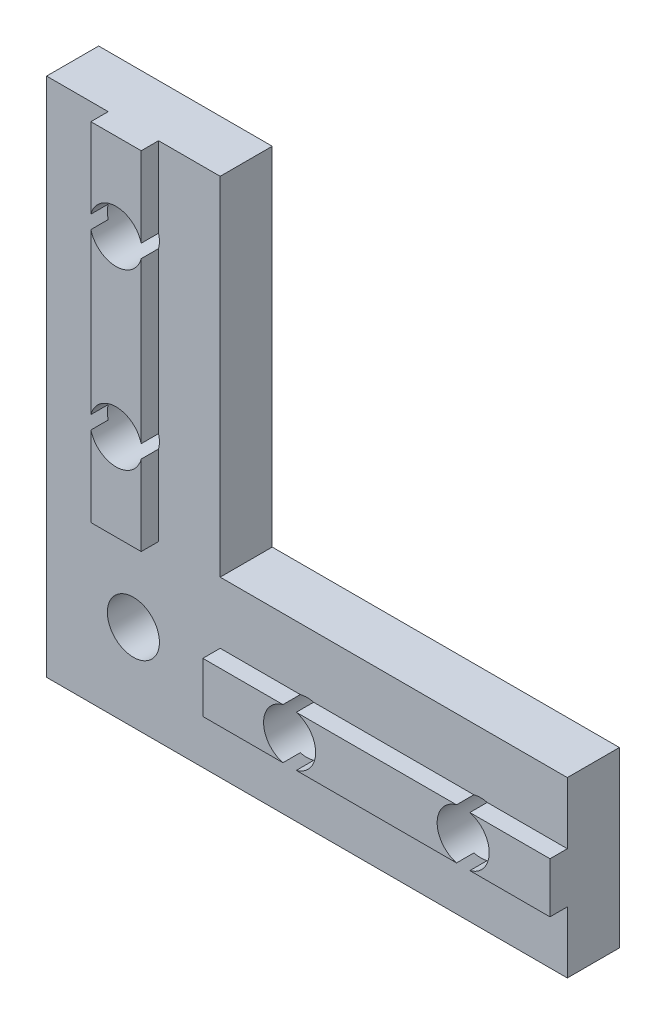
ISO-10303-21;
HEADER;
FILE_DESCRIPTION(('STEP AP214'),'2;1');
FILE_NAME('part.step','',(''),(''),'','','');
FILE_SCHEMA(('AUTOMOTIVE_DESIGN { 1 0 10303 214 1 1 1 1 }'));
ENDSEC;
DATA;
#1=APPLICATION_CONTEXT('core data for automotive mechanical design processes');
#2=APPLICATION_PROTOCOL_DEFINITION('international standard','automotive_design',2000,#1);
#3=PRODUCT_CONTEXT('',#1,'mechanical');
#4=PRODUCT('Part','Part','',(#3));
#5=PRODUCT_RELATED_PRODUCT_CATEGORY('part','',(#4));
#6=PRODUCT_DEFINITION_FORMATION('','',#4);
#7=PRODUCT_DEFINITION_CONTEXT('part definition',#1,'design');
#8=PRODUCT_DEFINITION('design','',#6,#7);
#9=PRODUCT_DEFINITION_SHAPE('','',#8);
#10=(LENGTH_UNIT() NAMED_UNIT(*) SI_UNIT(.MILLI.,.METRE.));
#11=(NAMED_UNIT(*) PLANE_ANGLE_UNIT() SI_UNIT($,.RADIAN.));
#12=(NAMED_UNIT(*) SI_UNIT($,.STERADIAN.) SOLID_ANGLE_UNIT());
#13=UNCERTAINTY_MEASURE_WITH_UNIT(LENGTH_MEASURE(1.E-05),#10,'distance_accuracy_value','');
#14=(GEOMETRIC_REPRESENTATION_CONTEXT(3) GLOBAL_UNCERTAINTY_ASSIGNED_CONTEXT((#13)) GLOBAL_UNIT_ASSIGNED_CONTEXT((#10,
#11,#12)) REPRESENTATION_CONTEXT('',''));
#15=CARTESIAN_POINT('',(0.,0.,0.));
#16=DIRECTION('',(0.,0.,1.));
#17=DIRECTION('',(1.,0.,0.));
#18=AXIS2_PLACEMENT_3D('',#15,#16,#17);
#19=CARTESIAN_POINT('',(6.45,30.,4.));
#20=DIRECTION('',(-1.,0.,0.));
#21=DIRECTION('',(0.,-1.,0.));
#22=AXIS2_PLACEMENT_3D('',#19,#20,#21);
#23=PLANE('',#22);
#24=DIRECTION('',(0.,1.,0.));
#25=VECTOR('',#24,1.);
#26=CARTESIAN_POINT('',(6.45,30.,3.));
#27=LINE('',#26,#25);
#28=CARTESIAN_POINT('',(6.45,10.,3.));
#29=VERTEX_POINT('',#28);
#30=CARTESIAN_POINT('',(6.45,14.6159427126066,3.));
#31=VERTEX_POINT('',#30);
#32=EDGE_CURVE('E332',#29,#31,#27,.T.);
#33=ORIENTED_EDGE('',*,*,#32,.T.);
#34=DIRECTION('',(0.,0.,1.));
#35=VECTOR('',#34,1.);
#36=CARTESIAN_POINT('',(6.45,14.6159427126066,0.));
#37=LINE('',#36,#35);
#38=CARTESIAN_POINT('',(6.45,14.6159427126066,4.));
#39=VERTEX_POINT('',#38);
#40=EDGE_CURVE('E288',#31,#39,#37,.T.);
#41=ORIENTED_EDGE('',*,*,#40,.T.);
#42=DIRECTION('',(0.,1.,0.));
#43=VECTOR('',#42,1.);
#44=CARTESIAN_POINT('',(6.45,30.,4.));
#45=LINE('',#44,#43);
#46=CARTESIAN_POINT('',(6.45,10.,4.));
#47=VERTEX_POINT('',#46);
#48=EDGE_CURVE('E339',#47,#39,#45,.T.);
#49=ORIENTED_EDGE('',*,*,#48,.F.);
#50=DIRECTION('',(0.,0.,-1.));
#51=VECTOR('',#50,1.);
#52=CARTESIAN_POINT('',(6.45,10.,4.));
#53=LINE('',#52,#51);
#54=EDGE_CURVE('E362',#47,#29,#53,.T.);
#55=ORIENTED_EDGE('',*,*,#54,.T.);
#56=EDGE_LOOP('',(#33,#41,#49,#55));
#57=FACE_BOUND('',#56,.T.);
#58=ADVANCED_FACE('F33',(#57),#23,.F.);
#59=CARTESIAN_POINT('',(3.55,30.,4.));
#60=DIRECTION('',(1.,0.,0.));
#61=DIRECTION('',(0.,1.,0.));
#62=AXIS2_PLACEMENT_3D('',#59,#60,#61);
#63=PLANE('',#62);
#64=DIRECTION('',(0.,-1.,0.));
#65=VECTOR('',#64,1.);
#66=CARTESIAN_POINT('',(3.55,30.,3.));
#67=LINE('',#66,#65);
#68=CARTESIAN_POINT('',(3.55,24.6159427126066,3.));
#69=VERTEX_POINT('',#68);
#70=CARTESIAN_POINT('',(3.55,15.3840572873934,3.));
#71=VERTEX_POINT('',#70);
#72=EDGE_CURVE('E323',#69,#71,#67,.T.);
#73=ORIENTED_EDGE('',*,*,#72,.T.);
#74=DIRECTION('',(0.,0.,1.));
#75=VECTOR('',#74,1.);
#76=CARTESIAN_POINT('',(3.55,15.3840572873934,0.));
#77=LINE('',#76,#75);
#78=CARTESIAN_POINT('',(3.55,15.3840572873934,4.));
#79=VERTEX_POINT('',#78);
#80=EDGE_CURVE('E291',#71,#79,#77,.T.);
#81=ORIENTED_EDGE('',*,*,#80,.T.);
#82=DIRECTION('',(0.,-1.,0.));
#83=VECTOR('',#82,1.);
#84=CARTESIAN_POINT('',(3.55,30.,4.));
#85=LINE('',#84,#83);
#86=CARTESIAN_POINT('',(3.55,24.6159427126066,4.));
#87=VERTEX_POINT('',#86);
#88=EDGE_CURVE('E321',#87,#79,#85,.T.);
#89=ORIENTED_EDGE('',*,*,#88,.F.);
#90=DIRECTION('',(0.,0.,1.));
#91=VECTOR('',#90,1.);
#92=CARTESIAN_POINT('',(3.55,24.6159427126066,0.));
#93=LINE('',#92,#91);
#94=EDGE_CURVE('E280',#87,#69,#93,.F.);
#95=ORIENTED_EDGE('',*,*,#94,.T.);
#96=EDGE_LOOP('',(#73,#81,#89,#95));
#97=FACE_BOUND('',#96,.T.);
#98=ADVANCED_FACE('F320',(#97),#63,.F.);
#99=CARTESIAN_POINT('',(0.,0.,4.));
#100=DIRECTION('',(0.,0.,1.));
#101=DIRECTION('',(1.,0.,0.));
#102=AXIS2_PLACEMENT_3D('',#99,#100,#101);
#103=PLANE('',#102);
#104=CARTESIAN_POINT('',(5.,15.,4.));
#105=DIRECTION('',(0.,0.,1.));
#106=DIRECTION('',(1.,0.,0.));
#107=AXIS2_PLACEMENT_3D('',#104,#105,#106);
#108=CIRCLE('',#107,1.5);
#109=CARTESIAN_POINT('',(6.45,15.3840572873934,4.));
#110=VERTEX_POINT('',#109);
#111=EDGE_CURVE('E310',#110,#79,#108,.T.);
#112=ORIENTED_EDGE('',*,*,#111,.F.);
#113=CARTESIAN_POINT('',(6.45,24.6159427126066,4.));
#114=VERTEX_POINT('',#113);
#115=EDGE_CURVE('E343',#110,#114,#45,.T.);
#116=ORIENTED_EDGE('',*,*,#115,.T.);
#117=CARTESIAN_POINT('',(5.,25.,4.));
#118=DIRECTION('',(0.,0.,1.));
#119=DIRECTION('',(1.,0.,0.));
#120=AXIS2_PLACEMENT_3D('',#117,#118,#119);
#121=CIRCLE('',#120,1.5);
#122=EDGE_CURVE('E287',#87,#114,#121,.T.);
#123=ORIENTED_EDGE('',*,*,#122,.F.);
#124=ORIENTED_EDGE('',*,*,#88,.T.);
#125=EDGE_LOOP('',(#112,#116,#123,#124));
#126=FACE_BOUND('',#125,.T.);
#127=ADVANCED_FACE('F325',(#126),#103,.T.);
#128=CARTESIAN_POINT('',(30.,6.45,4.));
#129=DIRECTION('',(0.,-1.,0.));
#130=DIRECTION('',(1.,0.,0.));
#131=AXIS2_PLACEMENT_3D('',#128,#129,#130);
#132=PLANE('',#131);
#133=DIRECTION('',(-1.,0.,0.));
#134=VECTOR('',#133,1.);
#135=CARTESIAN_POINT('',(30.,6.45,3.));
#136=LINE('',#135,#134);
#137=CARTESIAN_POINT('',(24.6159427126066,6.45,3.));
#138=VERTEX_POINT('',#137);
#139=CARTESIAN_POINT('',(15.3840572873934,6.44999999999999,3.));
#140=VERTEX_POINT('',#139);
#141=EDGE_CURVE('E466',#138,#140,#136,.T.);
#142=ORIENTED_EDGE('',*,*,#141,.T.);
#143=DIRECTION('',(0.,0.,1.));
#144=VECTOR('',#143,1.);
#145=CARTESIAN_POINT('',(15.3840572873934,6.44999999999999,0.));
#146=LINE('',#145,#144);
#147=CARTESIAN_POINT('',(15.3840572873934,6.44999999999999,4.));
#148=VERTEX_POINT('',#147);
#149=EDGE_CURVE('E296',#140,#148,#146,.T.);
#150=ORIENTED_EDGE('',*,*,#149,.T.);
#151=DIRECTION('',(-1.,0.,0.));
#152=VECTOR('',#151,1.);
#153=CARTESIAN_POINT('',(30.,6.45,4.));
#154=LINE('',#153,#152);
#155=CARTESIAN_POINT('',(24.6159427126066,6.45,4.));
#156=VERTEX_POINT('',#155);
#157=EDGE_CURVE('E257',#156,#148,#154,.T.);
#158=ORIENTED_EDGE('',*,*,#157,.F.);
#159=DIRECTION('',(0.,0.,1.));
#160=VECTOR('',#159,1.);
#161=CARTESIAN_POINT('',(24.6159427126066,6.45,0.));
#162=LINE('',#161,#160);
#163=EDGE_CURVE('E307',#156,#138,#162,.F.);
#164=ORIENTED_EDGE('',*,*,#163,.T.);
#165=EDGE_LOOP('',(#142,#150,#158,#164));
#166=FACE_BOUND('',#165,.T.);
#167=ADVANCED_FACE('F558',(#166),#132,.F.);
#168=CARTESIAN_POINT('',(30.,6.45,3.));
#169=VERTEX_POINT('',#168);
#170=CARTESIAN_POINT('',(25.3840572873934,6.45,3.));
#171=VERTEX_POINT('',#170);
#172=EDGE_CURVE('E247',#169,#171,#136,.T.);
#173=ORIENTED_EDGE('',*,*,#172,.T.);
#174=DIRECTION('',(0.,0.,1.));
#175=VECTOR('',#174,1.);
#176=CARTESIAN_POINT('',(25.3840572873934,6.45,0.));
#177=LINE('',#176,#175);
#178=CARTESIAN_POINT('',(25.3840572873934,6.45,4.));
#179=VERTEX_POINT('',#178);
#180=EDGE_CURVE('E232',#171,#179,#177,.T.);
#181=ORIENTED_EDGE('',*,*,#180,.T.);
#182=CARTESIAN_POINT('',(30.,6.45,4.));
#183=VERTEX_POINT('',#182);
#184=EDGE_CURVE('E244',#183,#179,#154,.T.);
#185=ORIENTED_EDGE('',*,*,#184,.F.);
#186=DIRECTION('',(0.,0.,-1.));
#187=VECTOR('',#186,1.);
#188=CARTESIAN_POINT('',(30.,6.45,4.));
#189=LINE('',#188,#187);
#190=EDGE_CURVE('E335',#183,#169,#189,.T.);
#191=ORIENTED_EDGE('',*,*,#190,.T.);
#192=EDGE_LOOP('',(#173,#181,#185,#191));
#193=FACE_BOUND('',#192,.T.);
#194=ADVANCED_FACE('F243',(#193),#132,.F.);
#195=CARTESIAN_POINT('',(30.,3.55,4.));
#196=DIRECTION('',(0.,1.,0.));
#197=DIRECTION('',(-1.,0.,0.));
#198=AXIS2_PLACEMENT_3D('',#195,#196,#197);
#199=PLANE('',#198);
#200=DIRECTION('',(1.,0.,0.));
#201=VECTOR('',#200,1.);
#202=CARTESIAN_POINT('',(30.,3.55,3.));
#203=LINE('',#202,#201);
#204=CARTESIAN_POINT('',(10.,3.55,3.));
#205=VERTEX_POINT('',#204);
#206=CARTESIAN_POINT('',(14.6159427126066,3.55,3.));
#207=VERTEX_POINT('',#206);
#208=EDGE_CURVE('E268',#205,#207,#203,.T.);
#209=ORIENTED_EDGE('',*,*,#208,.T.);
#210=DIRECTION('',(0.,0.,1.));
#211=VECTOR('',#210,1.);
#212=CARTESIAN_POINT('',(14.6159427126066,3.55,0.));
#213=LINE('',#212,#211);
#214=CARTESIAN_POINT('',(14.6159427126066,3.55,4.));
#215=VERTEX_POINT('',#214);
#216=EDGE_CURVE('E299',#207,#215,#213,.T.);
#217=ORIENTED_EDGE('',*,*,#216,.T.);
#218=DIRECTION('',(1.,0.,0.));
#219=VECTOR('',#218,1.);
#220=CARTESIAN_POINT('',(30.,3.55,4.));
#221=LINE('',#220,#219);
#222=CARTESIAN_POINT('',(10.,3.55,4.));
#223=VERTEX_POINT('',#222);
#224=EDGE_CURVE('E460',#223,#215,#221,.T.);
#225=ORIENTED_EDGE('',*,*,#224,.F.);
#226=DIRECTION('',(0.,0.,-1.));
#227=VECTOR('',#226,1.);
#228=CARTESIAN_POINT('',(10.,3.55,4.));
#229=LINE('',#228,#227);
#230=EDGE_CURVE('E470',#223,#205,#229,.T.);
#231=ORIENTED_EDGE('',*,*,#230,.T.);
#232=EDGE_LOOP('',(#209,#217,#225,#231));
#233=FACE_BOUND('',#232,.T.);
#234=ADVANCED_FACE('F570',(#233),#199,.F.);
#235=CARTESIAN_POINT('',(15.3840572873934,3.55,4.));
#236=VERTEX_POINT('',#235);
#237=CARTESIAN_POINT('',(24.6159427126066,3.55,4.));
#238=VERTEX_POINT('',#237);
#239=EDGE_CURVE('E453',#236,#238,#221,.T.);
#240=ORIENTED_EDGE('',*,*,#239,.F.);
#241=DIRECTION('',(0.,0.,1.));
#242=VECTOR('',#241,1.);
#243=CARTESIAN_POINT('',(15.3840572873934,3.55,0.));
#244=LINE('',#243,#242);
#245=CARTESIAN_POINT('',(15.3840572873934,3.55,3.));
#246=VERTEX_POINT('',#245);
#247=EDGE_CURVE('E249',#236,#246,#244,.F.);
#248=ORIENTED_EDGE('',*,*,#247,.T.);
#249=CARTESIAN_POINT('',(24.6159427126066,3.55,3.));
#250=VERTEX_POINT('',#249);
#251=EDGE_CURVE('E270',#246,#250,#203,.T.);
#252=ORIENTED_EDGE('',*,*,#251,.T.);
#253=DIRECTION('',(0.,0.,1.));
#254=VECTOR('',#253,1.);
#255=CARTESIAN_POINT('',(24.6159427126066,3.55,0.));
#256=LINE('',#255,#254);
#257=EDGE_CURVE('E250',#250,#238,#256,.T.);
#258=ORIENTED_EDGE('',*,*,#257,.T.);
#259=EDGE_LOOP('',(#240,#248,#252,#258));
#260=FACE_BOUND('',#259,.T.);
#261=ADVANCED_FACE('F457',(#260),#199,.F.);
#262=CARTESIAN_POINT('',(0.,0.,4.));
#263=DIRECTION('',(0.,0.,-1.));
#264=DIRECTION('',(-1.,0.,0.));
#265=AXIS2_PLACEMENT_3D('',#262,#263,#264);
#266=PLANE('',#265);
#267=ORIENTED_EDGE('',*,*,#157,.T.);
#268=CARTESIAN_POINT('',(15.,5.,4.));
#269=DIRECTION('',(0.,0.,-1.));
#270=DIRECTION('',(-1.,0.,0.));
#271=AXIS2_PLACEMENT_3D('',#268,#269,#270);
#272=CIRCLE('',#271,1.5);
#273=EDGE_CURVE('E41',#148,#236,#272,.T.);
#274=ORIENTED_EDGE('',*,*,#273,.T.);
#275=ORIENTED_EDGE('',*,*,#239,.T.);
#276=CARTESIAN_POINT('',(25.,5.,4.));
#277=DIRECTION('',(0.,0.,-1.));
#278=DIRECTION('',(-1.,0.,0.));
#279=AXIS2_PLACEMENT_3D('',#276,#277,#278);
#280=CIRCLE('',#279,1.5);
#281=EDGE_CURVE('E240',#238,#156,#280,.T.);
#282=ORIENTED_EDGE('',*,*,#281,.T.);
#283=EDGE_LOOP('',(#267,#274,#275,#282));
#284=FACE_BOUND('',#283,.T.);
#285=ADVANCED_FACE('F452',(#284),#266,.F.);
#286=ORIENTED_EDGE('',*,*,#184,.T.);
#287=CARTESIAN_POINT('',(25.3840572873934,3.55,4.));
#288=VERTEX_POINT('',#287);
#289=EDGE_CURVE('E227',#179,#288,#280,.T.);
#290=ORIENTED_EDGE('',*,*,#289,.T.);
#291=CARTESIAN_POINT('',(30.,3.55,4.));
#292=VERTEX_POINT('',#291);
#293=EDGE_CURVE('E260',#288,#292,#221,.T.);
#294=ORIENTED_EDGE('',*,*,#293,.T.);
#295=DIRECTION('',(0.,1.,0.));
#296=VECTOR('',#295,1.);
#297=CARTESIAN_POINT('',(30.,6.45,4.));
#298=LINE('',#297,#296);
#299=EDGE_CURVE('E254',#292,#183,#298,.T.);
#300=ORIENTED_EDGE('',*,*,#299,.T.);
#301=EDGE_LOOP('',(#286,#290,#294,#300));
#302=FACE_BOUND('',#301,.T.);
#303=ADVANCED_FACE('F252',(#302),#266,.F.);
#304=CARTESIAN_POINT('',(3.55,30.,3.));
#305=VERTEX_POINT('',#304);
#306=CARTESIAN_POINT('',(3.55,25.3840572873934,3.));
#307=VERTEX_POINT('',#306);
#308=EDGE_CURVE('E346',#305,#307,#67,.T.);
#309=ORIENTED_EDGE('',*,*,#308,.T.);
#310=DIRECTION('',(0.,0.,1.));
#311=VECTOR('',#310,1.);
#312=CARTESIAN_POINT('',(3.55,25.3840572873934,0.));
#313=LINE('',#312,#311);
#314=CARTESIAN_POINT('',(3.55,25.3840572873934,4.));
#315=VERTEX_POINT('',#314);
#316=EDGE_CURVE('E274',#307,#315,#313,.T.);
#317=ORIENTED_EDGE('',*,*,#316,.T.);
#318=CARTESIAN_POINT('',(3.55,30.,4.));
#319=VERTEX_POINT('',#318);
#320=EDGE_CURVE('E327',#319,#315,#85,.T.);
#321=ORIENTED_EDGE('',*,*,#320,.F.);
#322=DIRECTION('',(0.,0.,-1.));
#323=VECTOR('',#322,1.);
#324=CARTESIAN_POINT('',(3.55,30.,4.));
#325=LINE('',#324,#323);
#326=EDGE_CURVE('E345',#319,#305,#325,.T.);
#327=ORIENTED_EDGE('',*,*,#326,.T.);
#328=EDGE_LOOP('',(#309,#317,#321,#327));
#329=FACE_BOUND('',#328,.T.);
#330=ADVANCED_FACE('F538',(#329),#63,.F.);
#331=ORIENTED_EDGE('',*,*,#115,.F.);
#332=DIRECTION('',(0.,0.,1.));
#333=VECTOR('',#332,1.);
#334=CARTESIAN_POINT('',(6.45,15.3840572873934,0.));
#335=LINE('',#334,#333);
#336=CARTESIAN_POINT('',(6.45,15.3840572873934,3.));
#337=VERTEX_POINT('',#336);
#338=EDGE_CURVE('E48',#110,#337,#335,.F.);
#339=ORIENTED_EDGE('',*,*,#338,.T.);
#340=CARTESIAN_POINT('',(6.45,24.6159427126066,3.));
#341=VERTEX_POINT('',#340);
#342=EDGE_CURVE('E355',#337,#341,#27,.T.);
#343=ORIENTED_EDGE('',*,*,#342,.T.);
#344=DIRECTION('',(0.,0.,1.));
#345=VECTOR('',#344,1.);
#346=CARTESIAN_POINT('',(6.45,24.6159427126066,0.));
#347=LINE('',#346,#345);
#348=EDGE_CURVE('E282',#341,#114,#347,.T.);
#349=ORIENTED_EDGE('',*,*,#348,.T.);
#350=EDGE_LOOP('',(#331,#339,#343,#349));
#351=FACE_BOUND('',#350,.T.);
#352=ADVANCED_FACE('F527',(#351),#23,.F.);
#353=CARTESIAN_POINT('',(6.45,25.3840572873934,4.));
#354=VERTEX_POINT('',#353);
#355=EDGE_CURVE('E285',#354,#315,#121,.T.);
#356=ORIENTED_EDGE('',*,*,#355,.F.);
#357=CARTESIAN_POINT('',(6.45,30.,4.));
#358=VERTEX_POINT('',#357);
#359=EDGE_CURVE('E338',#354,#358,#45,.T.);
#360=ORIENTED_EDGE('',*,*,#359,.T.);
#361=DIRECTION('',(-1.,0.,0.));
#362=VECTOR('',#361,1.);
#363=CARTESIAN_POINT('',(3.55,30.,4.));
#364=LINE('',#363,#362);
#365=EDGE_CURVE('E342',#358,#319,#364,.T.);
#366=ORIENTED_EDGE('',*,*,#365,.T.);
#367=ORIENTED_EDGE('',*,*,#320,.T.);
#368=EDGE_LOOP('',(#356,#360,#366,#367));
#369=FACE_BOUND('',#368,.T.);
#370=ADVANCED_FACE('F530',(#369),#103,.T.);
#371=CARTESIAN_POINT('',(0.,0.,3.));
#372=DIRECTION('',(0.,0.,1.));
#373=DIRECTION('',(1.,0.,0.));
#374=AXIS2_PLACEMENT_3D('',#371,#372,#373);
#375=PLANE('',#374);
#376=CARTESIAN_POINT('',(5.,5.,3.));
#377=DIRECTION('',(0.,0.,1.));
#378=DIRECTION('',(1.,0.,0.));
#379=AXIS2_PLACEMENT_3D('',#376,#377,#378);
#380=CIRCLE('',#379,1.5);
#381=CARTESIAN_POINT('',(6.5,5.,3.));
#382=VERTEX_POINT('',#381);
#383=EDGE_CURVE('E382',#382,#382,#380,.T.);
#384=ORIENTED_EDGE('',*,*,#383,.F.);
#385=EDGE_LOOP('',(#384));
#386=FACE_BOUND('',#385,.T.);
#387=CARTESIAN_POINT('',(15.,5.,3.));
#388=DIRECTION('',(0.,0.,1.));
#389=DIRECTION('',(1.,0.,0.));
#390=AXIS2_PLACEMENT_3D('',#387,#388,#389);
#391=CIRCLE('',#390,1.5);
#392=CARTESIAN_POINT('',(14.6159427126066,6.44999999999999,3.));
#393=VERTEX_POINT('',#392);
#394=EDGE_CURVE('E375',#140,#393,#391,.T.);
#395=ORIENTED_EDGE('',*,*,#394,.F.);
#396=ORIENTED_EDGE('',*,*,#141,.F.);
#397=CARTESIAN_POINT('',(25.,5.,3.));
#398=DIRECTION('',(0.,0.,1.));
#399=DIRECTION('',(1.,0.,0.));
#400=AXIS2_PLACEMENT_3D('',#397,#398,#399);
#401=CIRCLE('',#400,1.5);
#402=EDGE_CURVE('E369',#171,#138,#401,.T.);
#403=ORIENTED_EDGE('',*,*,#402,.F.);
#404=ORIENTED_EDGE('',*,*,#172,.F.);
#405=DIRECTION('',(0.,1.,0.));
#406=VECTOR('',#405,1.);
#407=CARTESIAN_POINT('',(30.,0.,3.));
#408=LINE('',#407,#406);
#409=CARTESIAN_POINT('',(30.,10.,3.));
#410=VERTEX_POINT('',#409);
#411=EDGE_CURVE('E406',#169,#410,#408,.T.);
#412=ORIENTED_EDGE('',*,*,#411,.T.);
#413=DIRECTION('',(-1.,0.,0.));
#414=VECTOR('',#413,1.);
#415=CARTESIAN_POINT('',(30.,10.,3.));
#416=LINE('',#415,#414);
#417=CARTESIAN_POINT('',(10.,10.,3.));
#418=VERTEX_POINT('',#417);
#419=EDGE_CURVE('E410',#410,#418,#416,.T.);
#420=ORIENTED_EDGE('',*,*,#419,.T.);
#421=DIRECTION('',(0.,1.,0.));
#422=VECTOR('',#421,1.);
#423=CARTESIAN_POINT('',(10.,10.,3.));
#424=LINE('',#423,#422);
#425=CARTESIAN_POINT('',(10.,30.,3.));
#426=VERTEX_POINT('',#425);
#427=EDGE_CURVE('E412',#418,#426,#424,.T.);
#428=ORIENTED_EDGE('',*,*,#427,.T.);
#429=DIRECTION('',(-1.,0.,0.));
#430=VECTOR('',#429,1.);
#431=CARTESIAN_POINT('',(10.,30.,3.));
#432=LINE('',#431,#430);
#433=CARTESIAN_POINT('',(6.45,30.,3.));
#434=VERTEX_POINT('',#433);
#435=EDGE_CURVE('E415',#426,#434,#432,.T.);
#436=ORIENTED_EDGE('',*,*,#435,.T.);
#437=CARTESIAN_POINT('',(6.45,25.3840572873934,3.));
#438=VERTEX_POINT('',#437);
#439=EDGE_CURVE('E356',#438,#434,#27,.T.);
#440=ORIENTED_EDGE('',*,*,#439,.F.);
#441=CARTESIAN_POINT('',(5.,25.,3.));
#442=DIRECTION('',(0.,0.,1.));
#443=DIRECTION('',(1.,0.,0.));
#444=AXIS2_PLACEMENT_3D('',#441,#442,#443);
#445=CIRCLE('',#444,1.5);
#446=EDGE_CURVE('E393',#341,#438,#445,.T.);
#447=ORIENTED_EDGE('',*,*,#446,.F.);
#448=ORIENTED_EDGE('',*,*,#342,.F.);
#449=CARTESIAN_POINT('',(5.,15.,3.));
#450=DIRECTION('',(0.,0.,1.));
#451=DIRECTION('',(1.,0.,0.));
#452=AXIS2_PLACEMENT_3D('',#449,#450,#451);
#453=CIRCLE('',#452,1.5);
#454=EDGE_CURVE('E388',#31,#337,#453,.T.);
#455=ORIENTED_EDGE('',*,*,#454,.F.);
#456=ORIENTED_EDGE('',*,*,#32,.F.);
#457=DIRECTION('',(1.,0.,0.));
#458=VECTOR('',#457,1.);
#459=CARTESIAN_POINT('',(3.55,10.,3.));
#460=LINE('',#459,#458);
#461=CARTESIAN_POINT('',(3.55,10.,3.));
#462=VERTEX_POINT('',#461);
#463=EDGE_CURVE('E349',#462,#29,#460,.T.);
#464=ORIENTED_EDGE('',*,*,#463,.F.);
#465=CARTESIAN_POINT('',(3.55,14.6159427126066,3.));
#466=VERTEX_POINT('',#465);
#467=EDGE_CURVE('E350',#466,#462,#67,.T.);
#468=ORIENTED_EDGE('',*,*,#467,.F.);
#469=EDGE_CURVE('E390',#71,#466,#453,.T.);
#470=ORIENTED_EDGE('',*,*,#469,.F.);
#471=ORIENTED_EDGE('',*,*,#72,.F.);
#472=EDGE_CURVE('E396',#307,#69,#445,.T.);
#473=ORIENTED_EDGE('',*,*,#472,.F.);
#474=ORIENTED_EDGE('',*,*,#308,.F.);
#475=CARTESIAN_POINT('',(0.,30.,3.));
#476=VERTEX_POINT('',#475);
#477=EDGE_CURVE('E414',#305,#476,#432,.T.);
#478=ORIENTED_EDGE('',*,*,#477,.T.);
#479=DIRECTION('',(0.,-1.,0.));
#480=VECTOR('',#479,1.);
#481=CARTESIAN_POINT('',(0.,30.,3.));
#482=LINE('',#481,#480);
#483=CARTESIAN_POINT('',(0.,0.,3.));
#484=VERTEX_POINT('',#483);
#485=EDGE_CURVE('E400',#476,#484,#482,.T.);
#486=ORIENTED_EDGE('',*,*,#485,.T.);
#487=DIRECTION('',(1.,0.,0.));
#488=VECTOR('',#487,1.);
#489=CARTESIAN_POINT('',(0.,0.,3.));
#490=LINE('',#489,#488);
#491=CARTESIAN_POINT('',(30.,0.,3.));
#492=VERTEX_POINT('',#491);
#493=EDGE_CURVE('E403',#484,#492,#490,.T.);
#494=ORIENTED_EDGE('',*,*,#493,.T.);
#495=CARTESIAN_POINT('',(30.,3.55,3.));
#496=VERTEX_POINT('',#495);
#497=EDGE_CURVE('E407',#492,#496,#408,.T.);
#498=ORIENTED_EDGE('',*,*,#497,.T.);
#499=CARTESIAN_POINT('',(25.3840572873934,3.55,3.));
#500=VERTEX_POINT('',#499);
#501=EDGE_CURVE('E272',#500,#496,#203,.T.);
#502=ORIENTED_EDGE('',*,*,#501,.F.);
#503=EDGE_CURVE('E372',#250,#500,#401,.T.);
#504=ORIENTED_EDGE('',*,*,#503,.F.);
#505=ORIENTED_EDGE('',*,*,#251,.F.);
#506=EDGE_CURVE('E379',#207,#246,#391,.T.);
#507=ORIENTED_EDGE('',*,*,#506,.F.);
#508=ORIENTED_EDGE('',*,*,#208,.F.);
#509=DIRECTION('',(0.,-1.,0.));
#510=VECTOR('',#509,1.);
#511=CARTESIAN_POINT('',(10.,6.44999999999999,3.));
#512=LINE('',#511,#510);
#513=CARTESIAN_POINT('',(10.,6.44999999999999,3.));
#514=VERTEX_POINT('',#513);
#515=EDGE_CURVE('E465',#514,#205,#512,.T.);
#516=ORIENTED_EDGE('',*,*,#515,.F.);
#517=EDGE_CURVE('E277',#393,#514,#136,.T.);
#518=ORIENTED_EDGE('',*,*,#517,.F.);
#519=EDGE_LOOP('',(#395,#396,#403,#404,#412,#420,#428,#436,#440,#447,#448,#455,#456,#464,#468,
#470,#471,#473,#474,#478,#486,#494,#498,#502,#504,#505,#507,#508,#516,#518));
#520=FACE_BOUND('',#519,.T.);
#521=ADVANCED_FACE('F481',(#386,#520),#375,.T.);
#522=CARTESIAN_POINT('',(0.,0.,0.));
#523=DIRECTION('',(0.,0.,1.));
#524=DIRECTION('',(1.,0.,0.));
#525=AXIS2_PLACEMENT_3D('',#522,#523,#524);
#526=PLANE('',#525);
#527=DIRECTION('',(0.,-1.,0.));
#528=VECTOR('',#527,1.);
#529=CARTESIAN_POINT('',(0.,30.,0.));
#530=LINE('',#529,#528);
#531=CARTESIAN_POINT('',(0.,30.,0.));
#532=VERTEX_POINT('',#531);
#533=CARTESIAN_POINT('',(0.,0.,0.));
#534=VERTEX_POINT('',#533);
#535=EDGE_CURVE('E418',#532,#534,#530,.T.);
#536=ORIENTED_EDGE('',*,*,#535,.F.);
#537=DIRECTION('',(-1.,0.,0.));
#538=VECTOR('',#537,1.);
#539=CARTESIAN_POINT('',(10.,30.,0.));
#540=LINE('',#539,#538);
#541=CARTESIAN_POINT('',(10.,30.,0.));
#542=VERTEX_POINT('',#541);
#543=EDGE_CURVE('E404',#542,#532,#540,.T.);
#544=ORIENTED_EDGE('',*,*,#543,.F.);
#545=DIRECTION('',(0.,1.,0.));
#546=VECTOR('',#545,1.);
#547=CARTESIAN_POINT('',(10.,10.,0.));
#548=LINE('',#547,#546);
#549=CARTESIAN_POINT('',(10.,10.,0.));
#550=VERTEX_POINT('',#549);
#551=EDGE_CURVE('E427',#550,#542,#548,.T.);
#552=ORIENTED_EDGE('',*,*,#551,.F.);
#553=DIRECTION('',(-1.,0.,0.));
#554=VECTOR('',#553,1.);
#555=CARTESIAN_POINT('',(30.,10.,0.));
#556=LINE('',#555,#554);
#557=CARTESIAN_POINT('',(30.,10.,0.));
#558=VERTEX_POINT('',#557);
#559=EDGE_CURVE('E425',#558,#550,#556,.T.);
#560=ORIENTED_EDGE('',*,*,#559,.F.);
#561=DIRECTION('',(0.,1.,0.));
#562=VECTOR('',#561,1.);
#563=CARTESIAN_POINT('',(30.,0.,0.));
#564=LINE('',#563,#562);
#565=CARTESIAN_POINT('',(30.,0.,0.));
#566=VERTEX_POINT('',#565);
#567=EDGE_CURVE('E423',#566,#558,#564,.T.);
#568=ORIENTED_EDGE('',*,*,#567,.F.);
#569=DIRECTION('',(1.,0.,0.));
#570=VECTOR('',#569,1.);
#571=CARTESIAN_POINT('',(0.,0.,0.));
#572=LINE('',#571,#570);
#573=EDGE_CURVE('E421',#534,#566,#572,.T.);
#574=ORIENTED_EDGE('',*,*,#573,.F.);
#575=EDGE_LOOP('',(#536,#544,#552,#560,#568,#574));
#576=FACE_BOUND('',#575,.T.);
#577=CARTESIAN_POINT('',(5.,25.,0.));
#578=DIRECTION('',(0.,0.,1.));
#579=DIRECTION('',(1.,0.,0.));
#580=AXIS2_PLACEMENT_3D('',#577,#578,#579);
#581=CIRCLE('',#580,1.5);
#582=CARTESIAN_POINT('',(6.5,25.,0.));
#583=VERTEX_POINT('',#582);
#584=EDGE_CURVE('E397',#583,#583,#581,.T.);
#585=ORIENTED_EDGE('',*,*,#584,.T.);
#586=EDGE_LOOP('',(#585));
#587=FACE_BOUND('',#586,.T.);
#588=CARTESIAN_POINT('',(5.,15.,0.));
#589=DIRECTION('',(0.,0.,1.));
#590=DIRECTION('',(1.,0.,0.));
#591=AXIS2_PLACEMENT_3D('',#588,#589,#590);
#592=CIRCLE('',#591,1.5);
#593=CARTESIAN_POINT('',(6.5,15.,0.));
#594=VERTEX_POINT('',#593);
#595=EDGE_CURVE('E385',#594,#594,#592,.T.);
#596=ORIENTED_EDGE('',*,*,#595,.T.);
#597=EDGE_LOOP('',(#596));
#598=FACE_BOUND('',#597,.T.);
#599=CARTESIAN_POINT('',(5.,5.,0.));
#600=DIRECTION('',(0.,0.,1.));
#601=DIRECTION('',(1.,0.,0.));
#602=AXIS2_PLACEMENT_3D('',#599,#600,#601);
#603=CIRCLE('',#602,1.5);
#604=CARTESIAN_POINT('',(6.5,5.,0.));
#605=VERTEX_POINT('',#604);
#606=EDGE_CURVE('E378',#605,#605,#603,.T.);
#607=ORIENTED_EDGE('',*,*,#606,.T.);
#608=EDGE_LOOP('',(#607));
#609=FACE_BOUND('',#608,.T.);
#610=CARTESIAN_POINT('',(15.,5.,0.));
#611=DIRECTION('',(0.,0.,1.));
#612=DIRECTION('',(1.,0.,0.));
#613=AXIS2_PLACEMENT_3D('',#610,#611,#612);
#614=CIRCLE('',#613,1.5);
#615=CARTESIAN_POINT('',(16.5,5.,0.));
#616=VERTEX_POINT('',#615);
#617=EDGE_CURVE('E371',#616,#616,#614,.T.);
#618=ORIENTED_EDGE('',*,*,#617,.T.);
#619=EDGE_LOOP('',(#618));
#620=FACE_BOUND('',#619,.T.);
#621=CARTESIAN_POINT('',(25.,5.,0.));
#622=DIRECTION('',(0.,0.,1.));
#623=DIRECTION('',(1.,0.,0.));
#624=AXIS2_PLACEMENT_3D('',#621,#622,#623);
#625=CIRCLE('',#624,1.5);
#626=CARTESIAN_POINT('',(26.5,5.,0.));
#627=VERTEX_POINT('',#626);
#628=EDGE_CURVE('E368',#627,#627,#625,.T.);
#629=ORIENTED_EDGE('',*,*,#628,.T.);
#630=EDGE_LOOP('',(#629));
#631=FACE_BOUND('',#630,.T.);
#632=ADVANCED_FACE('F613',(#576,#587,#598,#609,#620,#631),#526,.F.);
#633=CARTESIAN_POINT('',(0.,30.,3.));
#634=DIRECTION('',(1.,0.,0.));
#635=DIRECTION('',(0.,1.,0.));
#636=AXIS2_PLACEMENT_3D('',#633,#634,#635);
#637=PLANE('',#636);
#638=ORIENTED_EDGE('',*,*,#535,.T.);
#639=DIRECTION('',(0.,0.,-1.));
#640=VECTOR('',#639,1.);
#641=CARTESIAN_POINT('',(0.,0.,3.));
#642=LINE('',#641,#640);
#643=EDGE_CURVE('E444',#484,#534,#642,.T.);
#644=ORIENTED_EDGE('',*,*,#643,.F.);
#645=ORIENTED_EDGE('',*,*,#485,.F.);
#646=DIRECTION('',(0.,0.,-1.));
#647=VECTOR('',#646,1.);
#648=CARTESIAN_POINT('',(0.,30.,3.));
#649=LINE('',#648,#647);
#650=EDGE_CURVE('E417',#476,#532,#649,.T.);
#651=ORIENTED_EDGE('',*,*,#650,.T.);
#652=EDGE_LOOP('',(#638,#644,#645,#651));
#653=FACE_BOUND('',#652,.T.);
#654=ADVANCED_FACE('F35',(#653),#637,.F.);
#655=CARTESIAN_POINT('',(0.,0.,3.));
#656=DIRECTION('',(0.,1.,0.));
#657=DIRECTION('',(0.,0.,1.));
#658=AXIS2_PLACEMENT_3D('',#655,#656,#657);
#659=PLANE('',#658);
#660=ORIENTED_EDGE('',*,*,#573,.T.);
#661=DIRECTION('',(0.,0.,-1.));
#662=VECTOR('',#661,1.);
#663=CARTESIAN_POINT('',(30.,0.,3.));
#664=LINE('',#663,#662);
#665=EDGE_CURVE('E441',#492,#566,#664,.T.);
#666=ORIENTED_EDGE('',*,*,#665,.F.);
#667=ORIENTED_EDGE('',*,*,#493,.F.);
#668=ORIENTED_EDGE('',*,*,#643,.T.);
#669=EDGE_LOOP('',(#660,#666,#667,#668));
#670=FACE_BOUND('',#669,.T.);
#671=ADVANCED_FACE('F549',(#670),#659,.F.);
#672=CARTESIAN_POINT('',(30.,0.,3.));
#673=DIRECTION('',(-1.,0.,0.));
#674=DIRECTION('',(0.,0.,1.));
#675=AXIS2_PLACEMENT_3D('',#672,#673,#674);
#676=PLANE('',#675);
#677=ORIENTED_EDGE('',*,*,#567,.T.);
#678=DIRECTION('',(0.,0.,-1.));
#679=VECTOR('',#678,1.);
#680=CARTESIAN_POINT('',(30.,10.,3.));
#681=LINE('',#680,#679);
#682=EDGE_CURVE('E438',#410,#558,#681,.T.);
#683=ORIENTED_EDGE('',*,*,#682,.F.);
#684=ORIENTED_EDGE('',*,*,#411,.F.);
#685=ORIENTED_EDGE('',*,*,#190,.F.);
#686=ORIENTED_EDGE('',*,*,#299,.F.);
#687=DIRECTION('',(0.,0.,-1.));
#688=VECTOR('',#687,1.);
#689=CARTESIAN_POINT('',(30.,3.55,4.));
#690=LINE('',#689,#688);
#691=EDGE_CURVE('E462',#292,#496,#690,.T.);
#692=ORIENTED_EDGE('',*,*,#691,.T.);
#693=ORIENTED_EDGE('',*,*,#497,.F.);
#694=ORIENTED_EDGE('',*,*,#665,.T.);
#695=EDGE_LOOP('',(#677,#683,#684,#685,#686,#692,#693,#694));
#696=FACE_BOUND('',#695,.T.);
#697=ADVANCED_FACE('F484',(#696),#676,.F.);
#698=CARTESIAN_POINT('',(30.,10.,3.));
#699=DIRECTION('',(0.,-1.,0.));
#700=DIRECTION('',(1.,0.,0.));
#701=AXIS2_PLACEMENT_3D('',#698,#699,#700);
#702=PLANE('',#701);
#703=ORIENTED_EDGE('',*,*,#559,.T.);
#704=DIRECTION('',(0.,0.,-1.));
#705=VECTOR('',#704,1.);
#706=CARTESIAN_POINT('',(10.,10.,3.));
#707=LINE('',#706,#705);
#708=EDGE_CURVE('E435',#418,#550,#707,.T.);
#709=ORIENTED_EDGE('',*,*,#708,.F.);
#710=ORIENTED_EDGE('',*,*,#419,.F.);
#711=ORIENTED_EDGE('',*,*,#682,.T.);
#712=EDGE_LOOP('',(#703,#709,#710,#711));
#713=FACE_BOUND('',#712,.T.);
#714=ADVANCED_FACE('F490',(#713),#702,.F.);
#715=CARTESIAN_POINT('',(10.,10.,3.));
#716=DIRECTION('',(-1.,0.,0.));
#717=DIRECTION('',(0.,-1.,0.));
#718=AXIS2_PLACEMENT_3D('',#715,#716,#717);
#719=PLANE('',#718);
#720=ORIENTED_EDGE('',*,*,#551,.T.);
#721=DIRECTION('',(0.,0.,-1.));
#722=VECTOR('',#721,1.);
#723=CARTESIAN_POINT('',(10.,30.,3.));
#724=LINE('',#723,#722);
#725=EDGE_CURVE('E432',#426,#542,#724,.T.);
#726=ORIENTED_EDGE('',*,*,#725,.F.);
#727=ORIENTED_EDGE('',*,*,#427,.F.);
#728=ORIENTED_EDGE('',*,*,#708,.T.);
#729=EDGE_LOOP('',(#720,#726,#727,#728));
#730=FACE_BOUND('',#729,.T.);
#731=ADVANCED_FACE('F497',(#730),#719,.F.);
#732=CARTESIAN_POINT('',(10.,30.,3.));
#733=DIRECTION('',(0.,-1.,0.));
#734=DIRECTION('',(0.,0.,-1.));
#735=AXIS2_PLACEMENT_3D('',#732,#733,#734);
#736=PLANE('',#735);
#737=ORIENTED_EDGE('',*,*,#543,.T.);
#738=ORIENTED_EDGE('',*,*,#650,.F.);
#739=ORIENTED_EDGE('',*,*,#477,.F.);
#740=ORIENTED_EDGE('',*,*,#326,.F.);
#741=ORIENTED_EDGE('',*,*,#365,.F.);
#742=DIRECTION('',(0.,0.,-1.));
#743=VECTOR('',#742,1.);
#744=CARTESIAN_POINT('',(6.45,30.,4.));
#745=LINE('',#744,#743);
#746=EDGE_CURVE('E359',#358,#434,#745,.T.);
#747=ORIENTED_EDGE('',*,*,#746,.T.);
#748=ORIENTED_EDGE('',*,*,#435,.F.);
#749=ORIENTED_EDGE('',*,*,#725,.T.);
#750=EDGE_LOOP('',(#737,#738,#739,#740,#741,#747,#748,#749));
#751=FACE_BOUND('',#750,.T.);
#752=ADVANCED_FACE('F501',(#751),#736,.F.);
#753=CARTESIAN_POINT('',(5.,25.,3.));
#754=DIRECTION('',(0.,0.,-1.));
#755=DIRECTION('',(-1.,0.,0.));
#756=AXIS2_PLACEMENT_3D('',#753,#754,#755);
#757=CYLINDRICAL_SURFACE('',#756,1.5);
#758=ORIENTED_EDGE('',*,*,#446,.T.);
#759=DIRECTION('',(0.,0.,1.));
#760=VECTOR('',#759,1.);
#761=CARTESIAN_POINT('',(6.45,25.3840572873934,0.));
#762=LINE('',#761,#760);
#763=EDGE_CURVE('E278',#354,#438,#762,.F.);
#764=ORIENTED_EDGE('',*,*,#763,.F.);
#765=ORIENTED_EDGE('',*,*,#355,.T.);
#766=ORIENTED_EDGE('',*,*,#316,.F.);
#767=ORIENTED_EDGE('',*,*,#472,.T.);
#768=ORIENTED_EDGE('',*,*,#94,.F.);
#769=ORIENTED_EDGE('',*,*,#122,.T.);
#770=ORIENTED_EDGE('',*,*,#348,.F.);
#771=EDGE_LOOP('',(#758,#764,#765,#766,#767,#768,#769,#770));
#772=FACE_BOUND('',#771,.T.);
#773=ORIENTED_EDGE('',*,*,#584,.F.);
#774=EDGE_LOOP('',(#773));
#775=FACE_BOUND('',#774,.T.);
#776=ADVANCED_FACE('F533',(#772,#775),#757,.F.);
#777=CARTESIAN_POINT('',(5.,15.,3.));
#778=DIRECTION('',(0.,0.,-1.));
#779=DIRECTION('',(-1.,0.,0.));
#780=AXIS2_PLACEMENT_3D('',#777,#778,#779);
#781=CYLINDRICAL_SURFACE('',#780,1.5);
#782=ORIENTED_EDGE('',*,*,#454,.T.);
#783=ORIENTED_EDGE('',*,*,#338,.F.);
#784=ORIENTED_EDGE('',*,*,#111,.T.);
#785=ORIENTED_EDGE('',*,*,#80,.F.);
#786=ORIENTED_EDGE('',*,*,#469,.T.);
#787=DIRECTION('',(0.,0.,1.));
#788=VECTOR('',#787,1.);
#789=CARTESIAN_POINT('',(3.55,14.6159427126066,0.));
#790=LINE('',#789,#788);
#791=CARTESIAN_POINT('',(3.55,14.6159427126066,4.));
#792=VERTEX_POINT('',#791);
#793=EDGE_CURVE('E54',#792,#466,#790,.F.);
#794=ORIENTED_EDGE('',*,*,#793,.F.);
#795=CARTESIAN_POINT('',(5.,15.,4.));
#796=DIRECTION('',(0.,0.,1.));
#797=DIRECTION('',(1.,0.,0.));
#798=AXIS2_PLACEMENT_3D('',#795,#796,#797);
#799=CIRCLE('',#798,1.5);
#800=EDGE_CURVE('E11',#792,#39,#799,.T.);
#801=ORIENTED_EDGE('',*,*,#800,.T.);
#802=ORIENTED_EDGE('',*,*,#40,.F.);
#803=EDGE_LOOP('',(#782,#783,#784,#785,#786,#794,#801,#802));
#804=FACE_BOUND('',#803,.T.);
#805=ORIENTED_EDGE('',*,*,#595,.F.);
#806=EDGE_LOOP('',(#805));
#807=FACE_BOUND('',#806,.T.);
#808=ADVANCED_FACE('F311',(#804,#807),#781,.F.);
#809=CARTESIAN_POINT('',(5.,5.,3.));
#810=DIRECTION('',(0.,0.,-1.));
#811=DIRECTION('',(-1.,0.,0.));
#812=AXIS2_PLACEMENT_3D('',#809,#810,#811);
#813=CYLINDRICAL_SURFACE('',#812,1.5);
#814=ORIENTED_EDGE('',*,*,#383,.T.);
#815=EDGE_LOOP('',(#814));
#816=FACE_BOUND('',#815,.T.);
#817=ORIENTED_EDGE('',*,*,#606,.F.);
#818=EDGE_LOOP('',(#817));
#819=FACE_BOUND('',#818,.T.);
#820=ADVANCED_FACE('F603',(#816,#819),#813,.F.);
#821=CARTESIAN_POINT('',(15.,5.,3.));
#822=DIRECTION('',(0.,0.,-1.));
#823=DIRECTION('',(-1.,0.,0.));
#824=AXIS2_PLACEMENT_3D('',#821,#822,#823);
#825=CYLINDRICAL_SURFACE('',#824,1.5);
#826=ORIENTED_EDGE('',*,*,#394,.T.);
#827=DIRECTION('',(0.,0.,1.));
#828=VECTOR('',#827,1.);
#829=CARTESIAN_POINT('',(14.6159427126066,6.44999999999999,0.));
#830=LINE('',#829,#828);
#831=CARTESIAN_POINT('',(14.6159427126066,6.44999999999999,4.));
#832=VERTEX_POINT('',#831);
#833=EDGE_CURVE('E302',#832,#393,#830,.F.);
#834=ORIENTED_EDGE('',*,*,#833,.F.);
#835=EDGE_CURVE('E239',#215,#832,#272,.T.);
#836=ORIENTED_EDGE('',*,*,#835,.F.);
#837=ORIENTED_EDGE('',*,*,#216,.F.);
#838=ORIENTED_EDGE('',*,*,#506,.T.);
#839=ORIENTED_EDGE('',*,*,#247,.F.);
#840=ORIENTED_EDGE('',*,*,#273,.F.);
#841=ORIENTED_EDGE('',*,*,#149,.F.);
#842=EDGE_LOOP('',(#826,#834,#836,#837,#838,#839,#840,#841));
#843=FACE_BOUND('',#842,.T.);
#844=ORIENTED_EDGE('',*,*,#617,.F.);
#845=EDGE_LOOP('',(#844));
#846=FACE_BOUND('',#845,.T.);
#847=ADVANCED_FACE('F559',(#843,#846),#825,.F.);
#848=CARTESIAN_POINT('',(25.,5.,3.));
#849=DIRECTION('',(0.,0.,-1.));
#850=DIRECTION('',(-1.,0.,0.));
#851=AXIS2_PLACEMENT_3D('',#848,#849,#850);
#852=CYLINDRICAL_SURFACE('',#851,1.5);
#853=ORIENTED_EDGE('',*,*,#402,.T.);
#854=ORIENTED_EDGE('',*,*,#163,.F.);
#855=ORIENTED_EDGE('',*,*,#281,.F.);
#856=ORIENTED_EDGE('',*,*,#257,.F.);
#857=ORIENTED_EDGE('',*,*,#503,.T.);
#858=DIRECTION('',(0.,0.,1.));
#859=VECTOR('',#858,1.);
#860=CARTESIAN_POINT('',(25.3840572873934,3.55,0.));
#861=LINE('',#860,#859);
#862=EDGE_CURVE('E235',#288,#500,#861,.F.);
#863=ORIENTED_EDGE('',*,*,#862,.F.);
#864=ORIENTED_EDGE('',*,*,#289,.F.);
#865=ORIENTED_EDGE('',*,*,#180,.F.);
#866=EDGE_LOOP('',(#853,#854,#855,#856,#857,#863,#864,#865));
#867=FACE_BOUND('',#866,.T.);
#868=ORIENTED_EDGE('',*,*,#628,.F.);
#869=EDGE_LOOP('',(#868));
#870=FACE_BOUND('',#869,.T.);
#871=ADVANCED_FACE('F230',(#867,#870),#852,.F.);
#872=CARTESIAN_POINT('',(3.55,10.,4.));
#873=VERTEX_POINT('',#872);
#874=EDGE_CURVE('E328',#792,#873,#85,.T.);
#875=ORIENTED_EDGE('',*,*,#874,.F.);
#876=ORIENTED_EDGE('',*,*,#793,.T.);
#877=ORIENTED_EDGE('',*,*,#467,.T.);
#878=DIRECTION('',(0.,0.,-1.));
#879=VECTOR('',#878,1.);
#880=CARTESIAN_POINT('',(3.55,10.,4.));
#881=LINE('',#880,#879);
#882=EDGE_CURVE('E365',#873,#462,#881,.T.);
#883=ORIENTED_EDGE('',*,*,#882,.F.);
#884=EDGE_LOOP('',(#875,#876,#877,#883));
#885=FACE_BOUND('',#884,.T.);
#886=ADVANCED_FACE('F515',(#885),#63,.F.);
#887=CARTESIAN_POINT('',(3.55,10.,4.));
#888=DIRECTION('',(0.,1.,0.));
#889=DIRECTION('',(0.,0.,1.));
#890=AXIS2_PLACEMENT_3D('',#887,#888,#889);
#891=PLANE('',#890);
#892=ORIENTED_EDGE('',*,*,#463,.T.);
#893=ORIENTED_EDGE('',*,*,#54,.F.);
#894=DIRECTION('',(1.,0.,0.));
#895=VECTOR('',#894,1.);
#896=CARTESIAN_POINT('',(3.55,10.,4.));
#897=LINE('',#896,#895);
#898=EDGE_CURVE('E331',#873,#47,#897,.T.);
#899=ORIENTED_EDGE('',*,*,#898,.F.);
#900=ORIENTED_EDGE('',*,*,#882,.T.);
#901=EDGE_LOOP('',(#892,#893,#899,#900));
#902=FACE_BOUND('',#901,.T.);
#903=ADVANCED_FACE('F518',(#902),#891,.F.);
#904=ORIENTED_EDGE('',*,*,#359,.F.);
#905=ORIENTED_EDGE('',*,*,#763,.T.);
#906=ORIENTED_EDGE('',*,*,#439,.T.);
#907=ORIENTED_EDGE('',*,*,#746,.F.);
#908=EDGE_LOOP('',(#904,#905,#906,#907));
#909=FACE_BOUND('',#908,.T.);
#910=ADVANCED_FACE('F507',(#909),#23,.F.);
#911=ORIENTED_EDGE('',*,*,#800,.F.);
#912=ORIENTED_EDGE('',*,*,#874,.T.);
#913=ORIENTED_EDGE('',*,*,#898,.T.);
#914=ORIENTED_EDGE('',*,*,#48,.T.);
#915=EDGE_LOOP('',(#911,#912,#913,#914));
#916=FACE_BOUND('',#915,.T.);
#917=ADVANCED_FACE('F522',(#916),#103,.T.);
#918=CARTESIAN_POINT('',(10.,6.44999999999999,4.));
#919=VERTEX_POINT('',#918);
#920=EDGE_CURVE('E259',#832,#919,#154,.T.);
#921=ORIENTED_EDGE('',*,*,#920,.F.);
#922=ORIENTED_EDGE('',*,*,#833,.T.);
#923=ORIENTED_EDGE('',*,*,#517,.T.);
#924=DIRECTION('',(0.,0.,-1.));
#925=VECTOR('',#924,1.);
#926=CARTESIAN_POINT('',(10.,6.44999999999999,4.));
#927=LINE('',#926,#925);
#928=EDGE_CURVE('E472',#919,#514,#927,.T.);
#929=ORIENTED_EDGE('',*,*,#928,.F.);
#930=EDGE_LOOP('',(#921,#922,#923,#929));
#931=FACE_BOUND('',#930,.T.);
#932=ADVANCED_FACE('F564',(#931),#132,.F.);
#933=CARTESIAN_POINT('',(10.,6.44999999999999,4.));
#934=DIRECTION('',(1.,0.,0.));
#935=DIRECTION('',(0.,1.,0.));
#936=AXIS2_PLACEMENT_3D('',#933,#934,#935);
#937=PLANE('',#936);
#938=ORIENTED_EDGE('',*,*,#515,.T.);
#939=ORIENTED_EDGE('',*,*,#230,.F.);
#940=DIRECTION('',(0.,-1.,0.));
#941=VECTOR('',#940,1.);
#942=CARTESIAN_POINT('',(10.,6.44999999999999,4.));
#943=LINE('',#942,#941);
#944=EDGE_CURVE('E256',#919,#223,#943,.T.);
#945=ORIENTED_EDGE('',*,*,#944,.F.);
#946=ORIENTED_EDGE('',*,*,#928,.T.);
#947=EDGE_LOOP('',(#938,#939,#945,#946));
#948=FACE_BOUND('',#947,.T.);
#949=ADVANCED_FACE('F566',(#948),#937,.F.);
#950=ORIENTED_EDGE('',*,*,#293,.F.);
#951=ORIENTED_EDGE('',*,*,#862,.T.);
#952=ORIENTED_EDGE('',*,*,#501,.T.);
#953=ORIENTED_EDGE('',*,*,#691,.F.);
#954=EDGE_LOOP('',(#950,#951,#952,#953));
#955=FACE_BOUND('',#954,.T.);
#956=ADVANCED_FACE('F552',(#955),#199,.F.);
#957=ORIENTED_EDGE('',*,*,#224,.T.);
#958=ORIENTED_EDGE('',*,*,#835,.T.);
#959=ORIENTED_EDGE('',*,*,#920,.T.);
#960=ORIENTED_EDGE('',*,*,#944,.T.);
#961=EDGE_LOOP('',(#957,#958,#959,#960));
#962=FACE_BOUND('',#961,.T.);
#963=ADVANCED_FACE('F568',(#962),#266,.F.);
#964=CLOSED_SHELL('',(#58,#98,#127,#167,#194,#234,#261,#285,#303,#330,#352,#370,#521,#632,#654,
#671,#697,#714,#731,#752,#776,#808,#820,#847,#871,#886,#903,#910,#917,#932,#949,#956,#963));
#965=MANIFOLD_SOLID_BREP('B2',#964);
#966=ADVANCED_BREP_SHAPE_REPRESENTATION('',(#18,#965),#14);
#967=SHAPE_DEFINITION_REPRESENTATION(#9,#966);
ENDSEC;
END-ISO-10303-21;
